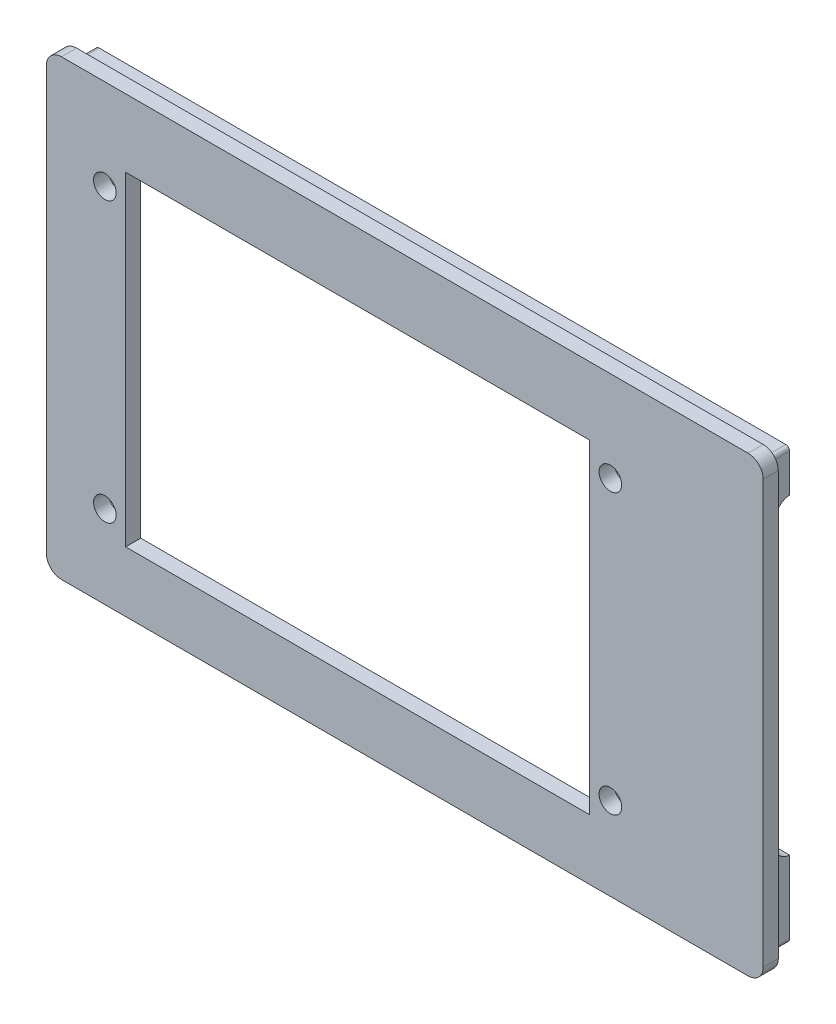
ISO-10303-21;
HEADER;
FILE_DESCRIPTION(('STEP AP214'),'2;1');
FILE_NAME('part.step','',(''),(''),'','','');
FILE_SCHEMA(('AUTOMOTIVE_DESIGN { 1 0 10303 214 1 1 1 1 }'));
ENDSEC;
DATA;
#1=APPLICATION_CONTEXT('core data for automotive mechanical design processes');
#2=APPLICATION_PROTOCOL_DEFINITION('international standard','automotive_design',2000,#1);
#3=PRODUCT_CONTEXT('',#1,'mechanical');
#4=PRODUCT('Part','Part','',(#3));
#5=PRODUCT_RELATED_PRODUCT_CATEGORY('part','',(#4));
#6=PRODUCT_DEFINITION_FORMATION('','',#4);
#7=PRODUCT_DEFINITION_CONTEXT('part definition',#1,'design');
#8=PRODUCT_DEFINITION('design','',#6,#7);
#9=PRODUCT_DEFINITION_SHAPE('','',#8);
#10=(LENGTH_UNIT() NAMED_UNIT(*) SI_UNIT(.MILLI.,.METRE.));
#11=(NAMED_UNIT(*) PLANE_ANGLE_UNIT() SI_UNIT($,.RADIAN.));
#12=(NAMED_UNIT(*) SI_UNIT($,.STERADIAN.) SOLID_ANGLE_UNIT());
#13=UNCERTAINTY_MEASURE_WITH_UNIT(LENGTH_MEASURE(1.E-05),#10,'distance_accuracy_value','');
#14=(GEOMETRIC_REPRESENTATION_CONTEXT(3) GLOBAL_UNCERTAINTY_ASSIGNED_CONTEXT((#13)) GLOBAL_UNIT_ASSIGNED_CONTEXT((#10,
#11,#12)) REPRESENTATION_CONTEXT('',''));
#15=CARTESIAN_POINT('',(0.,0.,0.));
#16=DIRECTION('',(0.,0.,1.));
#17=DIRECTION('',(1.,0.,0.));
#18=AXIS2_PLACEMENT_3D('',#15,#16,#17);
#19=CARTESIAN_POINT('',(93.,58.,0.));
#20=DIRECTION('',(0.,0.,-1.));
#21=DIRECTION('',(-1.,0.,0.));
#22=AXIS2_PLACEMENT_3D('',#19,#20,#21);
#23=PLANE('',#22);
#24=CARTESIAN_POINT('',(93.,58.,0.));
#25=DIRECTION('',(0.,0.,1.));
#26=DIRECTION('',(-1.,0.,0.));
#27=AXIS2_PLACEMENT_3D('',#24,#25,#26);
#28=CIRCLE('',#27,2.);
#29=CARTESIAN_POINT('',(95.,58.,0.));
#30=VERTEX_POINT('',#29);
#31=CARTESIAN_POINT('',(93.,60.,0.));
#32=VERTEX_POINT('',#31);
#33=EDGE_CURVE('E333',#30,#32,#28,.T.);
#34=ORIENTED_EDGE('',*,*,#33,.F.);
#35=DIRECTION('',(0.,1.,0.));
#36=VECTOR('',#35,1.);
#37=CARTESIAN_POINT('',(95.,2.00000000000001,0.));
#38=LINE('',#37,#36);
#39=CARTESIAN_POINT('',(95.,2.,0.));
#40=VERTEX_POINT('',#39);
#41=EDGE_CURVE('E338',#40,#30,#38,.T.);
#42=ORIENTED_EDGE('',*,*,#41,.F.);
#43=CARTESIAN_POINT('',(93.,2.,0.));
#44=DIRECTION('',(0.,0.,1.));
#45=DIRECTION('',(1.,0.,0.));
#46=AXIS2_PLACEMENT_3D('',#43,#44,#45);
#47=CIRCLE('',#46,2.);
#48=CARTESIAN_POINT('',(93.,0.,0.));
#49=VERTEX_POINT('',#48);
#50=EDGE_CURVE('E365',#49,#40,#47,.T.);
#51=ORIENTED_EDGE('',*,*,#50,.F.);
#52=DIRECTION('',(1.,0.,0.));
#53=VECTOR('',#52,1.);
#54=CARTESIAN_POINT('',(2.00000000000001,0.,0.));
#55=LINE('',#54,#53);
#56=CARTESIAN_POINT('',(2.00000000000001,0.,0.));
#57=VERTEX_POINT('',#56);
#58=EDGE_CURVE('E363',#57,#49,#55,.T.);
#59=ORIENTED_EDGE('',*,*,#58,.F.);
#60=CARTESIAN_POINT('',(2.,2.,0.));
#61=DIRECTION('',(0.,0.,1.));
#62=DIRECTION('',(-1.,0.,0.));
#63=AXIS2_PLACEMENT_3D('',#60,#61,#62);
#64=CIRCLE('',#63,2.);
#65=CARTESIAN_POINT('',(0.,2.00000000000001,0.));
#66=VERTEX_POINT('',#65);
#67=EDGE_CURVE('E361',#66,#57,#64,.T.);
#68=ORIENTED_EDGE('',*,*,#67,.F.);
#69=DIRECTION('',(0.,-1.,0.));
#70=VECTOR('',#69,1.);
#71=CARTESIAN_POINT('',(0.,2.00000000000001,0.));
#72=LINE('',#71,#70);
#73=CARTESIAN_POINT('',(0.,58.,0.));
#74=VERTEX_POINT('',#73);
#75=EDGE_CURVE('E359',#74,#66,#72,.T.);
#76=ORIENTED_EDGE('',*,*,#75,.F.);
#77=CARTESIAN_POINT('',(2.,58.,0.));
#78=DIRECTION('',(0.,0.,1.));
#79=DIRECTION('',(-1.,0.,0.));
#80=AXIS2_PLACEMENT_3D('',#77,#78,#79);
#81=CIRCLE('',#80,2.);
#82=CARTESIAN_POINT('',(2.00000000000001,60.,0.));
#83=VERTEX_POINT('',#82);
#84=EDGE_CURVE('E357',#83,#74,#81,.T.);
#85=ORIENTED_EDGE('',*,*,#84,.F.);
#86=DIRECTION('',(-1.,0.,0.));
#87=VECTOR('',#86,1.);
#88=CARTESIAN_POINT('',(2.00000000000001,60.,0.));
#89=LINE('',#88,#87);
#90=EDGE_CURVE('E355',#32,#83,#89,.T.);
#91=ORIENTED_EDGE('',*,*,#90,.F.);
#92=EDGE_LOOP('',(#34,#42,#51,#59,#68,#76,#85,#91));
#93=FACE_BOUND('',#92,.T.);
#94=DIRECTION('',(0.,-1.,0.));
#95=VECTOR('',#94,1.);
#96=CARTESIAN_POINT('',(93.5,58.,0.));
#97=LINE('',#96,#95);
#98=CARTESIAN_POINT('',(93.5,58.,0.));
#99=VERTEX_POINT('',#98);
#100=CARTESIAN_POINT('',(93.5,2.,0.));
#101=VERTEX_POINT('',#100);
#102=EDGE_CURVE('E270',#99,#101,#97,.T.);
#103=ORIENTED_EDGE('',*,*,#102,.F.);
#104=CARTESIAN_POINT('',(93.,58.,0.));
#105=DIRECTION('',(0.,0.,-1.));
#106=DIRECTION('',(-1.,0.,0.));
#107=AXIS2_PLACEMENT_3D('',#104,#105,#106);
#108=CIRCLE('',#107,0.5);
#109=CARTESIAN_POINT('',(93.,58.5,0.));
#110=VERTEX_POINT('',#109);
#111=EDGE_CURVE('E267',#110,#99,#108,.T.);
#112=ORIENTED_EDGE('',*,*,#111,.F.);
#113=DIRECTION('',(1.,0.,0.));
#114=VECTOR('',#113,1.);
#115=CARTESIAN_POINT('',(2.,58.5,0.));
#116=LINE('',#115,#114);
#117=CARTESIAN_POINT('',(2.,58.5,0.));
#118=VERTEX_POINT('',#117);
#119=EDGE_CURVE('E251',#118,#110,#116,.T.);
#120=ORIENTED_EDGE('',*,*,#119,.F.);
#121=CARTESIAN_POINT('',(2.,58.,0.));
#122=DIRECTION('',(0.,0.,-1.));
#123=DIRECTION('',(-1.,0.,0.));
#124=AXIS2_PLACEMENT_3D('',#121,#122,#123);
#125=CIRCLE('',#124,0.500000000000001);
#126=CARTESIAN_POINT('',(1.5,58.,0.));
#127=VERTEX_POINT('',#126);
#128=EDGE_CURVE('E281',#127,#118,#125,.T.);
#129=ORIENTED_EDGE('',*,*,#128,.F.);
#130=DIRECTION('',(0.,1.,0.));
#131=VECTOR('',#130,1.);
#132=CARTESIAN_POINT('',(1.5,2.,0.));
#133=LINE('',#132,#131);
#134=CARTESIAN_POINT('',(1.5,2.,0.));
#135=VERTEX_POINT('',#134);
#136=EDGE_CURVE('E279',#135,#127,#133,.T.);
#137=ORIENTED_EDGE('',*,*,#136,.F.);
#138=CARTESIAN_POINT('',(2.,2.,0.));
#139=DIRECTION('',(0.,0.,-1.));
#140=DIRECTION('',(-1.,0.,0.));
#141=AXIS2_PLACEMENT_3D('',#138,#139,#140);
#142=CIRCLE('',#141,0.5);
#143=CARTESIAN_POINT('',(2.00000000000002,1.5,0.));
#144=VERTEX_POINT('',#143);
#145=EDGE_CURVE('E277',#144,#135,#142,.T.);
#146=ORIENTED_EDGE('',*,*,#145,.F.);
#147=DIRECTION('',(-1.,0.,0.));
#148=VECTOR('',#147,1.);
#149=CARTESIAN_POINT('',(93.,1.5,0.));
#150=LINE('',#149,#148);
#151=CARTESIAN_POINT('',(93.,1.5,0.));
#152=VERTEX_POINT('',#151);
#153=EDGE_CURVE('E275',#152,#144,#150,.T.);
#154=ORIENTED_EDGE('',*,*,#153,.F.);
#155=CARTESIAN_POINT('',(93.,2.,0.));
#156=DIRECTION('',(0.,0.,-1.));
#157=DIRECTION('',(-1.,0.,0.));
#158=AXIS2_PLACEMENT_3D('',#155,#156,#157);
#159=CIRCLE('',#158,0.500000000000001);
#160=EDGE_CURVE('E273',#101,#152,#159,.T.);
#161=ORIENTED_EDGE('',*,*,#160,.F.);
#162=EDGE_LOOP('',(#103,#112,#120,#129,#137,#146,#154,#161));
#163=FACE_BOUND('',#162,.T.);
#164=ADVANCED_FACE('F34',(#93,#163),#23,.T.);
#165=CARTESIAN_POINT('',(93.,58.,2.));
#166=DIRECTION('',(0.,0.,-1.));
#167=DIRECTION('',(-1.,0.,0.));
#168=AXIS2_PLACEMENT_3D('',#165,#166,#167);
#169=PLANE('',#168);
#170=CARTESIAN_POINT('',(74.75,48.,2.));
#171=DIRECTION('',(0.,0.,1.));
#172=DIRECTION('',(1.,0.,0.));
#173=AXIS2_PLACEMENT_3D('',#170,#171,#172);
#174=CIRCLE('',#173,1.5);
#175=CARTESIAN_POINT('',(76.25,48.,2.));
#176=VERTEX_POINT('',#175);
#177=EDGE_CURVE('E763',#176,#176,#174,.T.);
#178=ORIENTED_EDGE('',*,*,#177,.F.);
#179=EDGE_LOOP('',(#178));
#180=FACE_BOUND('',#179,.T.);
#181=CARTESIAN_POINT('',(7.75000000000001,11.,2.));
#182=DIRECTION('',(0.,0.,1.));
#183=DIRECTION('',(1.,0.,0.));
#184=AXIS2_PLACEMENT_3D('',#181,#182,#183);
#185=CIRCLE('',#184,1.5);
#186=CARTESIAN_POINT('',(9.25000000000001,11.,2.));
#187=VERTEX_POINT('',#186);
#188=EDGE_CURVE('E820',#187,#187,#185,.T.);
#189=ORIENTED_EDGE('',*,*,#188,.F.);
#190=EDGE_LOOP('',(#189));
#191=FACE_BOUND('',#190,.T.);
#192=CARTESIAN_POINT('',(74.75,11.,2.));
#193=DIRECTION('',(0.,0.,1.));
#194=DIRECTION('',(1.,0.,0.));
#195=AXIS2_PLACEMENT_3D('',#192,#193,#194);
#196=CIRCLE('',#195,1.5);
#197=CARTESIAN_POINT('',(76.25,11.,2.));
#198=VERTEX_POINT('',#197);
#199=EDGE_CURVE('E814',#198,#198,#196,.T.);
#200=ORIENTED_EDGE('',*,*,#199,.F.);
#201=EDGE_LOOP('',(#200));
#202=FACE_BOUND('',#201,.T.);
#203=CARTESIAN_POINT('',(7.75000000000001,48.,2.));
#204=DIRECTION('',(0.,0.,1.));
#205=DIRECTION('',(1.,0.,0.));
#206=AXIS2_PLACEMENT_3D('',#203,#204,#205);
#207=CIRCLE('',#206,1.5);
#208=CARTESIAN_POINT('',(9.25000000000001,48.,2.));
#209=VERTEX_POINT('',#208);
#210=EDGE_CURVE('E758',#209,#209,#207,.T.);
#211=ORIENTED_EDGE('',*,*,#210,.F.);
#212=EDGE_LOOP('',(#211));
#213=FACE_BOUND('',#212,.T.);
#214=CARTESIAN_POINT('',(93.,58.,2.));
#215=DIRECTION('',(0.,0.,1.));
#216=DIRECTION('',(-1.,0.,0.));
#217=AXIS2_PLACEMENT_3D('',#214,#215,#216);
#218=CIRCLE('',#217,2.);
#219=CARTESIAN_POINT('',(95.,58.,2.));
#220=VERTEX_POINT('',#219);
#221=CARTESIAN_POINT('',(93.,60.,2.));
#222=VERTEX_POINT('',#221);
#223=EDGE_CURVE('E334',#220,#222,#218,.T.);
#224=ORIENTED_EDGE('',*,*,#223,.T.);
#225=DIRECTION('',(-1.,0.,0.));
#226=VECTOR('',#225,1.);
#227=CARTESIAN_POINT('',(2.00000000000001,60.,2.));
#228=LINE('',#227,#226);
#229=CARTESIAN_POINT('',(2.00000000000001,60.,2.));
#230=VERTEX_POINT('',#229);
#231=EDGE_CURVE('E337',#222,#230,#228,.T.);
#232=ORIENTED_EDGE('',*,*,#231,.T.);
#233=CARTESIAN_POINT('',(2.,58.,2.));
#234=DIRECTION('',(0.,0.,1.));
#235=DIRECTION('',(-1.,0.,0.));
#236=AXIS2_PLACEMENT_3D('',#233,#234,#235);
#237=CIRCLE('',#236,2.);
#238=CARTESIAN_POINT('',(0.,58.,2.));
#239=VERTEX_POINT('',#238);
#240=EDGE_CURVE('E340',#230,#239,#237,.T.);
#241=ORIENTED_EDGE('',*,*,#240,.T.);
#242=DIRECTION('',(0.,-1.,0.));
#243=VECTOR('',#242,1.);
#244=CARTESIAN_POINT('',(0.,2.00000000000001,2.));
#245=LINE('',#244,#243);
#246=CARTESIAN_POINT('',(0.,2.00000000000001,2.));
#247=VERTEX_POINT('',#246);
#248=EDGE_CURVE('E342',#239,#247,#245,.T.);
#249=ORIENTED_EDGE('',*,*,#248,.T.);
#250=CARTESIAN_POINT('',(2.,2.,2.));
#251=DIRECTION('',(0.,0.,1.));
#252=DIRECTION('',(-1.,0.,0.));
#253=AXIS2_PLACEMENT_3D('',#250,#251,#252);
#254=CIRCLE('',#253,2.);
#255=CARTESIAN_POINT('',(2.00000000000001,0.,2.));
#256=VERTEX_POINT('',#255);
#257=EDGE_CURVE('E344',#247,#256,#254,.T.);
#258=ORIENTED_EDGE('',*,*,#257,.T.);
#259=DIRECTION('',(1.,0.,0.));
#260=VECTOR('',#259,1.);
#261=CARTESIAN_POINT('',(2.00000000000001,0.,2.));
#262=LINE('',#261,#260);
#263=CARTESIAN_POINT('',(93.,0.,2.));
#264=VERTEX_POINT('',#263);
#265=EDGE_CURVE('E346',#256,#264,#262,.T.);
#266=ORIENTED_EDGE('',*,*,#265,.T.);
#267=CARTESIAN_POINT('',(93.,2.,2.));
#268=DIRECTION('',(0.,0.,1.));
#269=DIRECTION('',(1.,0.,0.));
#270=AXIS2_PLACEMENT_3D('',#267,#268,#269);
#271=CIRCLE('',#270,2.);
#272=CARTESIAN_POINT('',(95.,2.,2.));
#273=VERTEX_POINT('',#272);
#274=EDGE_CURVE('E348',#264,#273,#271,.T.);
#275=ORIENTED_EDGE('',*,*,#274,.T.);
#276=DIRECTION('',(0.,1.,0.));
#277=VECTOR('',#276,1.);
#278=CARTESIAN_POINT('',(95.,2.00000000000001,2.));
#279=LINE('',#278,#277);
#280=EDGE_CURVE('E350',#273,#220,#279,.T.);
#281=ORIENTED_EDGE('',*,*,#280,.T.);
#282=EDGE_LOOP('',(#224,#232,#241,#249,#258,#266,#275,#281));
#283=FACE_BOUND('',#282,.T.);
#284=DIRECTION('',(0.,-1.,0.));
#285=VECTOR('',#284,1.);
#286=CARTESIAN_POINT('',(10.5,51.,2.));
#287=LINE('',#286,#285);
#288=CARTESIAN_POINT('',(10.5,51.,2.));
#289=VERTEX_POINT('',#288);
#290=CARTESIAN_POINT('',(10.5,8.,2.));
#291=VERTEX_POINT('',#290);
#292=EDGE_CURVE('E303',#289,#291,#287,.T.);
#293=ORIENTED_EDGE('',*,*,#292,.F.);
#294=DIRECTION('',(-1.,0.,0.));
#295=VECTOR('',#294,1.);
#296=CARTESIAN_POINT('',(10.5,51.,2.));
#297=LINE('',#296,#295);
#298=CARTESIAN_POINT('',(72.,51.,2.));
#299=VERTEX_POINT('',#298);
#300=EDGE_CURVE('E311',#299,#289,#297,.T.);
#301=ORIENTED_EDGE('',*,*,#300,.F.);
#302=DIRECTION('',(0.,1.,0.));
#303=VECTOR('',#302,1.);
#304=CARTESIAN_POINT('',(72.,51.,2.));
#305=LINE('',#304,#303);
#306=CARTESIAN_POINT('',(72.,8.,2.));
#307=VERTEX_POINT('',#306);
#308=EDGE_CURVE('E308',#307,#299,#305,.T.);
#309=ORIENTED_EDGE('',*,*,#308,.F.);
#310=DIRECTION('',(1.,0.,0.));
#311=VECTOR('',#310,1.);
#312=CARTESIAN_POINT('',(10.5,8.,2.));
#313=LINE('',#312,#311);
#314=EDGE_CURVE('E305',#291,#307,#313,.T.);
#315=ORIENTED_EDGE('',*,*,#314,.F.);
#316=EDGE_LOOP('',(#293,#301,#309,#315));
#317=FACE_BOUND('',#316,.T.);
#318=ADVANCED_FACE('F408',(#180,#191,#202,#213,#283,#317),#169,.F.);
#319=CARTESIAN_POINT('',(74.75,48.,0.));
#320=DIRECTION('',(0.,0.,-1.));
#321=DIRECTION('',(-1.,0.,0.));
#322=AXIS2_PLACEMENT_3D('',#319,#320,#321);
#323=CIRCLE('',#322,1.5);
#324=CARTESIAN_POINT('',(73.25,48.,0.));
#325=VERTEX_POINT('',#324);
#326=EDGE_CURVE('E452',#325,#325,#323,.F.);
#327=ORIENTED_EDGE('',*,*,#326,.T.);
#328=EDGE_LOOP('',(#327));
#329=FACE_BOUND('',#328,.T.);
#330=CARTESIAN_POINT('',(7.75000000000001,11.,0.));
#331=DIRECTION('',(0.,0.,-1.));
#332=DIRECTION('',(-1.,0.,0.));
#333=AXIS2_PLACEMENT_3D('',#330,#331,#332);
#334=CIRCLE('',#333,1.5);
#335=CARTESIAN_POINT('',(6.25000000000001,11.,0.));
#336=VERTEX_POINT('',#335);
#337=EDGE_CURVE('E456',#336,#336,#334,.F.);
#338=ORIENTED_EDGE('',*,*,#337,.T.);
#339=EDGE_LOOP('',(#338));
#340=FACE_BOUND('',#339,.T.);
#341=CARTESIAN_POINT('',(74.75,11.,0.));
#342=DIRECTION('',(0.,0.,-1.));
#343=DIRECTION('',(-1.,0.,0.));
#344=AXIS2_PLACEMENT_3D('',#341,#342,#343);
#345=CIRCLE('',#344,1.5);
#346=CARTESIAN_POINT('',(73.25,11.,0.));
#347=VERTEX_POINT('',#346);
#348=EDGE_CURVE('E460',#347,#347,#345,.F.);
#349=ORIENTED_EDGE('',*,*,#348,.T.);
#350=EDGE_LOOP('',(#349));
#351=FACE_BOUND('',#350,.T.);
#352=CARTESIAN_POINT('',(7.75000000000001,48.,0.));
#353=DIRECTION('',(0.,0.,-1.));
#354=DIRECTION('',(-1.,0.,0.));
#355=AXIS2_PLACEMENT_3D('',#352,#353,#354);
#356=CIRCLE('',#355,1.5);
#357=CARTESIAN_POINT('',(6.25000000000001,48.,0.));
#358=VERTEX_POINT('',#357);
#359=EDGE_CURVE('E464',#358,#358,#356,.F.);
#360=ORIENTED_EDGE('',*,*,#359,.T.);
#361=EDGE_LOOP('',(#360));
#362=FACE_BOUND('',#361,.T.);
#363=DIRECTION('',(1.,0.,0.));
#364=VECTOR('',#363,1.);
#365=CARTESIAN_POINT('',(3.,57.,0.));
#366=LINE('',#365,#364);
#367=CARTESIAN_POINT('',(3.,57.,0.));
#368=VERTEX_POINT('',#367);
#369=CARTESIAN_POINT('',(92.,57.,0.));
#370=VERTEX_POINT('',#369);
#371=EDGE_CURVE('E467',#368,#370,#366,.T.);
#372=ORIENTED_EDGE('',*,*,#371,.T.);
#373=DIRECTION('',(0.,-1.,0.));
#374=VECTOR('',#373,1.);
#375=CARTESIAN_POINT('',(92.,57.,0.));
#376=LINE('',#375,#374);
#377=CARTESIAN_POINT('',(92.,3.,0.));
#378=VERTEX_POINT('',#377);
#379=EDGE_CURVE('E761',#370,#378,#376,.T.);
#380=ORIENTED_EDGE('',*,*,#379,.T.);
#381=DIRECTION('',(-1.,0.,0.));
#382=VECTOR('',#381,1.);
#383=CARTESIAN_POINT('',(92.,3.,0.));
#384=LINE('',#383,#382);
#385=CARTESIAN_POINT('',(3.,3.,0.));
#386=VERTEX_POINT('',#385);
#387=EDGE_CURVE('E781',#378,#386,#384,.T.);
#388=ORIENTED_EDGE('',*,*,#387,.T.);
#389=DIRECTION('',(0.,1.,0.));
#390=VECTOR('',#389,1.);
#391=CARTESIAN_POINT('',(3.,3.,0.));
#392=LINE('',#391,#390);
#393=EDGE_CURVE('E770',#386,#368,#392,.T.);
#394=ORIENTED_EDGE('',*,*,#393,.T.);
#395=EDGE_LOOP('',(#372,#380,#388,#394));
#396=FACE_BOUND('',#395,.T.);
#397=DIRECTION('',(-1.,0.,0.));
#398=VECTOR('',#397,1.);
#399=CARTESIAN_POINT('',(10.5,51.,0.));
#400=LINE('',#399,#398);
#401=CARTESIAN_POINT('',(72.,51.,0.));
#402=VERTEX_POINT('',#401);
#403=CARTESIAN_POINT('',(10.5,51.,0.));
#404=VERTEX_POINT('',#403);
#405=EDGE_CURVE('E306',#402,#404,#400,.T.);
#406=ORIENTED_EDGE('',*,*,#405,.T.);
#407=DIRECTION('',(0.,-1.,0.));
#408=VECTOR('',#407,1.);
#409=CARTESIAN_POINT('',(10.5,51.,0.));
#410=LINE('',#409,#408);
#411=CARTESIAN_POINT('',(10.5,8.,0.));
#412=VERTEX_POINT('',#411);
#413=EDGE_CURVE('E302',#404,#412,#410,.T.);
#414=ORIENTED_EDGE('',*,*,#413,.T.);
#415=DIRECTION('',(1.,0.,0.));
#416=VECTOR('',#415,1.);
#417=CARTESIAN_POINT('',(10.5,8.,0.));
#418=LINE('',#417,#416);
#419=CARTESIAN_POINT('',(72.,8.,0.));
#420=VERTEX_POINT('',#419);
#421=EDGE_CURVE('E316',#412,#420,#418,.T.);
#422=ORIENTED_EDGE('',*,*,#421,.T.);
#423=DIRECTION('',(0.,1.,0.));
#424=VECTOR('',#423,1.);
#425=CARTESIAN_POINT('',(72.,51.,0.));
#426=LINE('',#425,#424);
#427=EDGE_CURVE('E319',#420,#402,#426,.T.);
#428=ORIENTED_EDGE('',*,*,#427,.T.);
#429=EDGE_LOOP('',(#406,#414,#422,#428));
#430=FACE_BOUND('',#429,.T.);
#431=ADVANCED_FACE('F437',(#329,#340,#351,#362,#396,#430),#23,.T.);
#432=CARTESIAN_POINT('',(93.,58.,2.));
#433=DIRECTION('',(0.,0.,-1.));
#434=DIRECTION('',(-1.,0.,0.));
#435=AXIS2_PLACEMENT_3D('',#432,#433,#434);
#436=CYLINDRICAL_SURFACE('',#435,2.);
#437=ORIENTED_EDGE('',*,*,#33,.T.);
#438=DIRECTION('',(0.,0.,-1.));
#439=VECTOR('',#438,1.);
#440=CARTESIAN_POINT('',(93.,60.,2.));
#441=LINE('',#440,#439);
#442=EDGE_CURVE('E11',#222,#32,#441,.T.);
#443=ORIENTED_EDGE('',*,*,#442,.F.);
#444=ORIENTED_EDGE('',*,*,#223,.F.);
#445=DIRECTION('',(0.,0.,-1.));
#446=VECTOR('',#445,1.);
#447=CARTESIAN_POINT('',(95.,58.,2.));
#448=LINE('',#447,#446);
#449=EDGE_CURVE('E352',#220,#30,#448,.T.);
#450=ORIENTED_EDGE('',*,*,#449,.T.);
#451=EDGE_LOOP('',(#437,#443,#444,#450));
#452=FACE_BOUND('',#451,.T.);
#453=ADVANCED_FACE('F36',(#452),#436,.T.);
#454=CARTESIAN_POINT('',(2.00000000000001,60.,2.));
#455=DIRECTION('',(0.,-1.,0.));
#456=DIRECTION('',(0.,0.,-1.));
#457=AXIS2_PLACEMENT_3D('',#454,#455,#456);
#458=PLANE('',#457);
#459=ORIENTED_EDGE('',*,*,#90,.T.);
#460=DIRECTION('',(0.,0.,-1.));
#461=VECTOR('',#460,1.);
#462=CARTESIAN_POINT('',(2.00000000000001,60.,2.));
#463=LINE('',#462,#461);
#464=EDGE_CURVE('E42',#230,#83,#463,.T.);
#465=ORIENTED_EDGE('',*,*,#464,.F.);
#466=ORIENTED_EDGE('',*,*,#231,.F.);
#467=ORIENTED_EDGE('',*,*,#442,.T.);
#468=EDGE_LOOP('',(#459,#465,#466,#467));
#469=FACE_BOUND('',#468,.T.);
#470=ADVANCED_FACE('F413',(#469),#458,.F.);
#471=CARTESIAN_POINT('',(2.,58.,2.));
#472=DIRECTION('',(0.,0.,-1.));
#473=DIRECTION('',(-1.,0.,0.));
#474=AXIS2_PLACEMENT_3D('',#471,#472,#473);
#475=CYLINDRICAL_SURFACE('',#474,2.);
#476=ORIENTED_EDGE('',*,*,#84,.T.);
#477=DIRECTION('',(0.,0.,-1.));
#478=VECTOR('',#477,1.);
#479=CARTESIAN_POINT('',(0.,58.,2.));
#480=LINE('',#479,#478);
#481=EDGE_CURVE('E382',#239,#74,#480,.T.);
#482=ORIENTED_EDGE('',*,*,#481,.F.);
#483=ORIENTED_EDGE('',*,*,#240,.F.);
#484=ORIENTED_EDGE('',*,*,#464,.T.);
#485=EDGE_LOOP('',(#476,#482,#483,#484));
#486=FACE_BOUND('',#485,.T.);
#487=ADVANCED_FACE('F389',(#486),#475,.T.);
#488=CARTESIAN_POINT('',(0.,2.00000000000001,2.));
#489=DIRECTION('',(1.,0.,0.));
#490=DIRECTION('',(0.,0.,-1.));
#491=AXIS2_PLACEMENT_3D('',#488,#489,#490);
#492=PLANE('',#491);
#493=ORIENTED_EDGE('',*,*,#75,.T.);
#494=DIRECTION('',(0.,0.,-1.));
#495=VECTOR('',#494,1.);
#496=CARTESIAN_POINT('',(0.,2.00000000000001,2.));
#497=LINE('',#496,#495);
#498=EDGE_CURVE('E379',#247,#66,#497,.T.);
#499=ORIENTED_EDGE('',*,*,#498,.F.);
#500=ORIENTED_EDGE('',*,*,#248,.F.);
#501=ORIENTED_EDGE('',*,*,#481,.T.);
#502=EDGE_LOOP('',(#493,#499,#500,#501));
#503=FACE_BOUND('',#502,.T.);
#504=ADVANCED_FACE('F400',(#503),#492,.F.);
#505=CARTESIAN_POINT('',(2.,2.,2.));
#506=DIRECTION('',(0.,0.,-1.));
#507=DIRECTION('',(-1.,0.,0.));
#508=AXIS2_PLACEMENT_3D('',#505,#506,#507);
#509=CYLINDRICAL_SURFACE('',#508,2.);
#510=ORIENTED_EDGE('',*,*,#67,.T.);
#511=DIRECTION('',(0.,0.,-1.));
#512=VECTOR('',#511,1.);
#513=CARTESIAN_POINT('',(2.00000000000001,0.,2.));
#514=LINE('',#513,#512);
#515=EDGE_CURVE('E376',#256,#57,#514,.T.);
#516=ORIENTED_EDGE('',*,*,#515,.F.);
#517=ORIENTED_EDGE('',*,*,#257,.F.);
#518=ORIENTED_EDGE('',*,*,#498,.T.);
#519=EDGE_LOOP('',(#510,#516,#517,#518));
#520=FACE_BOUND('',#519,.T.);
#521=ADVANCED_FACE('F404',(#520),#509,.T.);
#522=CARTESIAN_POINT('',(2.00000000000001,0.,2.));
#523=DIRECTION('',(0.,1.,0.));
#524=DIRECTION('',(0.,0.,1.));
#525=AXIS2_PLACEMENT_3D('',#522,#523,#524);
#526=PLANE('',#525);
#527=ORIENTED_EDGE('',*,*,#58,.T.);
#528=DIRECTION('',(0.,0.,-1.));
#529=VECTOR('',#528,1.);
#530=CARTESIAN_POINT('',(93.,0.,2.));
#531=LINE('',#530,#529);
#532=EDGE_CURVE('E373',#264,#49,#531,.T.);
#533=ORIENTED_EDGE('',*,*,#532,.F.);
#534=ORIENTED_EDGE('',*,*,#265,.F.);
#535=ORIENTED_EDGE('',*,*,#515,.T.);
#536=EDGE_LOOP('',(#527,#533,#534,#535));
#537=FACE_BOUND('',#536,.T.);
#538=ADVANCED_FACE('F426',(#537),#526,.F.);
#539=CARTESIAN_POINT('',(93.,2.,2.));
#540=DIRECTION('',(0.,0.,-1.));
#541=DIRECTION('',(-1.,0.,0.));
#542=AXIS2_PLACEMENT_3D('',#539,#540,#541);
#543=CYLINDRICAL_SURFACE('',#542,2.);
#544=ORIENTED_EDGE('',*,*,#50,.T.);
#545=DIRECTION('',(0.,0.,-1.));
#546=VECTOR('',#545,1.);
#547=CARTESIAN_POINT('',(95.,2.,2.));
#548=LINE('',#547,#546);
#549=EDGE_CURVE('E370',#273,#40,#548,.T.);
#550=ORIENTED_EDGE('',*,*,#549,.F.);
#551=ORIENTED_EDGE('',*,*,#274,.F.);
#552=ORIENTED_EDGE('',*,*,#532,.T.);
#553=EDGE_LOOP('',(#544,#550,#551,#552));
#554=FACE_BOUND('',#553,.T.);
#555=ADVANCED_FACE('F424',(#554),#543,.T.);
#556=CARTESIAN_POINT('',(95.,2.00000000000001,2.));
#557=DIRECTION('',(-1.,0.,0.));
#558=DIRECTION('',(0.,0.,1.));
#559=AXIS2_PLACEMENT_3D('',#556,#557,#558);
#560=PLANE('',#559);
#561=ORIENTED_EDGE('',*,*,#41,.T.);
#562=ORIENTED_EDGE('',*,*,#449,.F.);
#563=ORIENTED_EDGE('',*,*,#280,.F.);
#564=ORIENTED_EDGE('',*,*,#549,.T.);
#565=EDGE_LOOP('',(#561,#562,#563,#564));
#566=FACE_BOUND('',#565,.T.);
#567=ADVANCED_FACE('F419',(#566),#560,.F.);
#568=CARTESIAN_POINT('',(10.5,51.,2.));
#569=DIRECTION('',(1.,0.,0.));
#570=DIRECTION('',(0.,1.,0.));
#571=AXIS2_PLACEMENT_3D('',#568,#569,#570);
#572=PLANE('',#571);
#573=ORIENTED_EDGE('',*,*,#413,.F.);
#574=DIRECTION('',(0.,0.,-1.));
#575=VECTOR('',#574,1.);
#576=CARTESIAN_POINT('',(10.5,51.,2.));
#577=LINE('',#576,#575);
#578=EDGE_CURVE('E313',#289,#404,#577,.T.);
#579=ORIENTED_EDGE('',*,*,#578,.F.);
#580=ORIENTED_EDGE('',*,*,#292,.T.);
#581=DIRECTION('',(0.,0.,-1.));
#582=VECTOR('',#581,1.);
#583=CARTESIAN_POINT('',(10.5,8.,2.));
#584=LINE('',#583,#582);
#585=EDGE_CURVE('E330',#291,#412,#584,.T.);
#586=ORIENTED_EDGE('',*,*,#585,.T.);
#587=EDGE_LOOP('',(#573,#579,#580,#586));
#588=FACE_BOUND('',#587,.T.);
#589=ADVANCED_FACE('F477',(#588),#572,.T.);
#590=CARTESIAN_POINT('',(10.5,8.,2.));
#591=DIRECTION('',(0.,1.,0.));
#592=DIRECTION('',(0.,0.,1.));
#593=AXIS2_PLACEMENT_3D('',#590,#591,#592);
#594=PLANE('',#593);
#595=ORIENTED_EDGE('',*,*,#421,.F.);
#596=ORIENTED_EDGE('',*,*,#585,.F.);
#597=ORIENTED_EDGE('',*,*,#314,.T.);
#598=DIRECTION('',(0.,0.,-1.));
#599=VECTOR('',#598,1.);
#600=CARTESIAN_POINT('',(72.,8.,2.));
#601=LINE('',#600,#599);
#602=EDGE_CURVE('E328',#307,#420,#601,.T.);
#603=ORIENTED_EDGE('',*,*,#602,.T.);
#604=EDGE_LOOP('',(#595,#596,#597,#603));
#605=FACE_BOUND('',#604,.T.);
#606=ADVANCED_FACE('F483',(#605),#594,.T.);
#607=CARTESIAN_POINT('',(72.,51.,2.));
#608=DIRECTION('',(-1.,0.,0.));
#609=DIRECTION('',(0.,-1.,0.));
#610=AXIS2_PLACEMENT_3D('',#607,#608,#609);
#611=PLANE('',#610);
#612=ORIENTED_EDGE('',*,*,#427,.F.);
#613=ORIENTED_EDGE('',*,*,#602,.F.);
#614=ORIENTED_EDGE('',*,*,#308,.T.);
#615=DIRECTION('',(0.,0.,-1.));
#616=VECTOR('',#615,1.);
#617=CARTESIAN_POINT('',(72.,51.,2.));
#618=LINE('',#617,#616);
#619=EDGE_CURVE('E326',#299,#402,#618,.T.);
#620=ORIENTED_EDGE('',*,*,#619,.T.);
#621=EDGE_LOOP('',(#612,#613,#614,#620));
#622=FACE_BOUND('',#621,.T.);
#623=ADVANCED_FACE('F485',(#622),#611,.T.);
#624=CARTESIAN_POINT('',(10.5,51.,2.));
#625=DIRECTION('',(0.,-1.,0.));
#626=DIRECTION('',(0.,0.,-1.));
#627=AXIS2_PLACEMENT_3D('',#624,#625,#626);
#628=PLANE('',#627);
#629=ORIENTED_EDGE('',*,*,#405,.F.);
#630=ORIENTED_EDGE('',*,*,#619,.F.);
#631=ORIENTED_EDGE('',*,*,#300,.T.);
#632=ORIENTED_EDGE('',*,*,#578,.T.);
#633=EDGE_LOOP('',(#629,#630,#631,#632));
#634=FACE_BOUND('',#633,.T.);
#635=ADVANCED_FACE('F472',(#634),#628,.T.);
#636=CARTESIAN_POINT('',(93.,58.,-3.));
#637=DIRECTION('',(0.,0.,-1.));
#638=DIRECTION('',(-1.,0.,0.));
#639=AXIS2_PLACEMENT_3D('',#636,#637,#638);
#640=PLANE('',#639);
#641=DIRECTION('',(1.,0.,0.));
#642=VECTOR('',#641,1.);
#643=CARTESIAN_POINT('',(-0.001000000000001,11.623250188063,-3.));
#644=LINE('',#643,#642);
#645=CARTESIAN_POINT('',(92.,11.623250188063,-3.));
#646=VERTEX_POINT('',#645);
#647=CARTESIAN_POINT('',(93.5,11.623250188063,-3.));
#648=VERTEX_POINT('',#647);
#649=EDGE_CURVE('E222',#646,#648,#644,.T.);
#650=ORIENTED_EDGE('',*,*,#649,.T.);
#651=DIRECTION('',(0.,-1.,0.));
#652=VECTOR('',#651,1.);
#653=CARTESIAN_POINT('',(93.5,58.,-3.));
#654=LINE('',#653,#652);
#655=CARTESIAN_POINT('',(93.5,2.,-3.));
#656=VERTEX_POINT('',#655);
#657=EDGE_CURVE('E235',#648,#656,#654,.T.);
#658=ORIENTED_EDGE('',*,*,#657,.T.);
#659=CARTESIAN_POINT('',(93.,2.,-3.));
#660=DIRECTION('',(0.,0.,-1.));
#661=DIRECTION('',(-1.,0.,0.));
#662=AXIS2_PLACEMENT_3D('',#659,#660,#661);
#663=CIRCLE('',#662,0.500000000000001);
#664=CARTESIAN_POINT('',(93.,1.5,-3.));
#665=VERTEX_POINT('',#664);
#666=EDGE_CURVE('E249',#656,#665,#663,.T.);
#667=ORIENTED_EDGE('',*,*,#666,.T.);
#668=DIRECTION('',(-1.,0.,0.));
#669=VECTOR('',#668,1.);
#670=CARTESIAN_POINT('',(93.,1.5,-3.));
#671=LINE('',#670,#669);
#672=CARTESIAN_POINT('',(2.00000000000002,1.5,-3.));
#673=VERTEX_POINT('',#672);
#674=EDGE_CURVE('E256',#665,#673,#671,.T.);
#675=ORIENTED_EDGE('',*,*,#674,.T.);
#676=CARTESIAN_POINT('',(2.,2.,-3.));
#677=DIRECTION('',(0.,0.,-1.));
#678=DIRECTION('',(-1.,0.,0.));
#679=AXIS2_PLACEMENT_3D('',#676,#677,#678);
#680=CIRCLE('',#679,0.5);
#681=CARTESIAN_POINT('',(1.5,2.,-3.));
#682=VERTEX_POINT('',#681);
#683=EDGE_CURVE('E258',#673,#682,#680,.T.);
#684=ORIENTED_EDGE('',*,*,#683,.T.);
#685=DIRECTION('',(0.,1.,0.));
#686=VECTOR('',#685,1.);
#687=CARTESIAN_POINT('',(1.5,2.,-3.));
#688=LINE('',#687,#686);
#689=CARTESIAN_POINT('',(1.5,58.,-3.));
#690=VERTEX_POINT('',#689);
#691=EDGE_CURVE('E260',#682,#690,#688,.T.);
#692=ORIENTED_EDGE('',*,*,#691,.T.);
#693=CARTESIAN_POINT('',(2.,58.,-3.));
#694=DIRECTION('',(0.,0.,-1.));
#695=DIRECTION('',(-1.,0.,0.));
#696=AXIS2_PLACEMENT_3D('',#693,#694,#695);
#697=CIRCLE('',#696,0.500000000000001);
#698=CARTESIAN_POINT('',(2.,58.5,-3.));
#699=VERTEX_POINT('',#698);
#700=EDGE_CURVE('E262',#690,#699,#697,.T.);
#701=ORIENTED_EDGE('',*,*,#700,.T.);
#702=DIRECTION('',(1.,0.,0.));
#703=VECTOR('',#702,1.);
#704=CARTESIAN_POINT('',(2.,58.5,-3.));
#705=LINE('',#704,#703);
#706=CARTESIAN_POINT('',(93.,58.5,-3.));
#707=VERTEX_POINT('',#706);
#708=EDGE_CURVE('E264',#699,#707,#705,.T.);
#709=ORIENTED_EDGE('',*,*,#708,.T.);
#710=CARTESIAN_POINT('',(93.,58.,-3.));
#711=DIRECTION('',(0.,0.,-1.));
#712=DIRECTION('',(-1.,0.,0.));
#713=AXIS2_PLACEMENT_3D('',#710,#711,#712);
#714=CIRCLE('',#713,0.5);
#715=CARTESIAN_POINT('',(93.5,58.,-3.));
#716=VERTEX_POINT('',#715);
#717=EDGE_CURVE('E246',#707,#716,#714,.T.);
#718=ORIENTED_EDGE('',*,*,#717,.T.);
#719=CARTESIAN_POINT('',(93.5,52.9397731770604,-3.));
#720=VERTEX_POINT('',#719);
#721=EDGE_CURVE('E245',#716,#720,#654,.T.);
#722=ORIENTED_EDGE('',*,*,#721,.T.);
#723=DIRECTION('',(1.,0.,0.));
#724=VECTOR('',#723,1.);
#725=CARTESIAN_POINT('',(-0.001000000000001,52.9397731770604,-3.));
#726=LINE('',#725,#724);
#727=CARTESIAN_POINT('',(92.,52.9397731770604,-3.));
#728=VERTEX_POINT('',#727);
#729=EDGE_CURVE('E239',#720,#728,#726,.F.);
#730=ORIENTED_EDGE('',*,*,#729,.T.);
#731=DIRECTION('',(0.,-1.,0.));
#732=VECTOR('',#731,1.);
#733=CARTESIAN_POINT('',(92.,57.,-3.));
#734=LINE('',#733,#732);
#735=CARTESIAN_POINT('',(92.,57.,-3.));
#736=VERTEX_POINT('',#735);
#737=EDGE_CURVE('E771',#736,#728,#734,.T.);
#738=ORIENTED_EDGE('',*,*,#737,.F.);
#739=DIRECTION('',(1.,0.,0.));
#740=VECTOR('',#739,1.);
#741=CARTESIAN_POINT('',(3.,57.,-3.));
#742=LINE('',#741,#740);
#743=CARTESIAN_POINT('',(3.,57.,-3.));
#744=VERTEX_POINT('',#743);
#745=EDGE_CURVE('E768',#744,#736,#742,.T.);
#746=ORIENTED_EDGE('',*,*,#745,.F.);
#747=DIRECTION('',(0.,1.,0.));
#748=VECTOR('',#747,1.);
#749=CARTESIAN_POINT('',(3.,3.,-3.));
#750=LINE('',#749,#748);
#751=CARTESIAN_POINT('',(3.,3.,-3.));
#752=VERTEX_POINT('',#751);
#753=EDGE_CURVE('E777',#752,#744,#750,.T.);
#754=ORIENTED_EDGE('',*,*,#753,.F.);
#755=DIRECTION('',(-1.,0.,0.));
#756=VECTOR('',#755,1.);
#757=CARTESIAN_POINT('',(92.,3.,-3.));
#758=LINE('',#757,#756);
#759=CARTESIAN_POINT('',(92.,3.,-3.));
#760=VERTEX_POINT('',#759);
#761=EDGE_CURVE('E774',#760,#752,#758,.T.);
#762=ORIENTED_EDGE('',*,*,#761,.F.);
#763=EDGE_CURVE('E238',#646,#760,#734,.T.);
#764=ORIENTED_EDGE('',*,*,#763,.F.);
#765=EDGE_LOOP('',(#650,#658,#667,#675,#684,#692,#701,#709,#718,#722,#730,#738,#746,#754,#762,#764));
#766=FACE_BOUND('',#765,.T.);
#767=ADVANCED_FACE('F234',(#766),#640,.T.);
#768=CARTESIAN_POINT('',(93.,58.,-3.));
#769=DIRECTION('',(0.,0.,1.));
#770=DIRECTION('',(1.,0.,0.));
#771=AXIS2_PLACEMENT_3D('',#768,#769,#770);
#772=CYLINDRICAL_SURFACE('',#771,0.5);
#773=ORIENTED_EDGE('',*,*,#111,.T.);
#774=DIRECTION('',(0.,0.,1.));
#775=VECTOR('',#774,1.);
#776=CARTESIAN_POINT('',(93.5,58.,-3.));
#777=LINE('',#776,#775);
#778=EDGE_CURVE('E300',#716,#99,#777,.T.);
#779=ORIENTED_EDGE('',*,*,#778,.F.);
#780=ORIENTED_EDGE('',*,*,#717,.F.);
#781=DIRECTION('',(0.,0.,1.));
#782=VECTOR('',#781,1.);
#783=CARTESIAN_POINT('',(93.,58.5,-3.));
#784=LINE('',#783,#782);
#785=EDGE_CURVE('E266',#707,#110,#784,.T.);
#786=ORIENTED_EDGE('',*,*,#785,.T.);
#787=EDGE_LOOP('',(#773,#779,#780,#786));
#788=FACE_BOUND('',#787,.T.);
#789=ADVANCED_FACE('F658',(#788),#772,.T.);
#790=CARTESIAN_POINT('',(93.5,58.,-3.));
#791=DIRECTION('',(-1.,0.,0.));
#792=DIRECTION('',(0.,0.,1.));
#793=AXIS2_PLACEMENT_3D('',#790,#791,#792);
#794=PLANE('',#793);
#795=ORIENTED_EDGE('',*,*,#657,.F.);
#796=CARTESIAN_POINT('',(93.5,13.621155890472,-3.09150302881255));
#797=DIRECTION('',(1.,0.,0.));
#798=DIRECTION('',(0.,0.,1.));
#799=AXIS2_PLACEMENT_3D('',#796,#797,#798);
#800=CIRCLE('',#799,2.);
#801=CARTESIAN_POINT('',(93.5,13.621155890472,-1.09150302881255));
#802=VERTEX_POINT('',#801);
#803=EDGE_CURVE('E219',#802,#648,#800,.T.);
#804=ORIENTED_EDGE('',*,*,#803,.F.);
#805=DIRECTION('',(0.,-1.,0.));
#806=VECTOR('',#805,1.);
#807=CARTESIAN_POINT('',(93.5,13.621155890472,-1.09150302881255));
#808=LINE('',#807,#806);
#809=CARTESIAN_POINT('',(93.5,50.9418674746514,-1.09150302881255));
#810=VERTEX_POINT('',#809);
#811=EDGE_CURVE('E230',#810,#802,#808,.T.);
#812=ORIENTED_EDGE('',*,*,#811,.F.);
#813=CARTESIAN_POINT('',(93.5,50.9418674746514,-3.09150302881255));
#814=DIRECTION('',(1.,0.,0.));
#815=DIRECTION('',(0.,0.,-1.));
#816=AXIS2_PLACEMENT_3D('',#813,#814,#815);
#817=CIRCLE('',#816,2.);
#818=EDGE_CURVE('E806',#720,#810,#817,.T.);
#819=ORIENTED_EDGE('',*,*,#818,.F.);
#820=ORIENTED_EDGE('',*,*,#721,.F.);
#821=ORIENTED_EDGE('',*,*,#778,.T.);
#822=ORIENTED_EDGE('',*,*,#102,.T.);
#823=DIRECTION('',(0.,0.,1.));
#824=VECTOR('',#823,1.);
#825=CARTESIAN_POINT('',(93.5,2.,-3.));
#826=LINE('',#825,#824);
#827=EDGE_CURVE('E243',#656,#101,#826,.T.);
#828=ORIENTED_EDGE('',*,*,#827,.F.);
#829=EDGE_LOOP('',(#795,#804,#812,#819,#820,#821,#822,#828));
#830=FACE_BOUND('',#829,.T.);
#831=ADVANCED_FACE('F241',(#830),#794,.F.);
#832=CARTESIAN_POINT('',(93.,2.,-3.));
#833=DIRECTION('',(0.,0.,1.));
#834=DIRECTION('',(1.,0.,0.));
#835=AXIS2_PLACEMENT_3D('',#832,#833,#834);
#836=CYLINDRICAL_SURFACE('',#835,0.500000000000001);
#837=ORIENTED_EDGE('',*,*,#160,.T.);
#838=DIRECTION('',(0.,0.,1.));
#839=VECTOR('',#838,1.);
#840=CARTESIAN_POINT('',(93.,1.5,-3.));
#841=LINE('',#840,#839);
#842=EDGE_CURVE('E296',#665,#152,#841,.T.);
#843=ORIENTED_EDGE('',*,*,#842,.F.);
#844=ORIENTED_EDGE('',*,*,#666,.F.);
#845=ORIENTED_EDGE('',*,*,#827,.T.);
#846=EDGE_LOOP('',(#837,#843,#844,#845));
#847=FACE_BOUND('',#846,.T.);
#848=ADVANCED_FACE('F641',(#847),#836,.T.);
#849=CARTESIAN_POINT('',(93.,1.5,-3.));
#850=DIRECTION('',(0.,1.,0.));
#851=DIRECTION('',(-1.,0.,0.));
#852=AXIS2_PLACEMENT_3D('',#849,#850,#851);
#853=PLANE('',#852);
#854=ORIENTED_EDGE('',*,*,#153,.T.);
#855=DIRECTION('',(0.,0.,1.));
#856=VECTOR('',#855,1.);
#857=CARTESIAN_POINT('',(2.00000000000002,1.5,-3.));
#858=LINE('',#857,#856);
#859=EDGE_CURVE('E293',#673,#144,#858,.T.);
#860=ORIENTED_EDGE('',*,*,#859,.F.);
#861=ORIENTED_EDGE('',*,*,#674,.F.);
#862=ORIENTED_EDGE('',*,*,#842,.T.);
#863=EDGE_LOOP('',(#854,#860,#861,#862));
#864=FACE_BOUND('',#863,.T.);
#865=ADVANCED_FACE('F631',(#864),#853,.F.);
#866=CARTESIAN_POINT('',(2.,2.,-3.));
#867=DIRECTION('',(0.,0.,1.));
#868=DIRECTION('',(1.,0.,0.));
#869=AXIS2_PLACEMENT_3D('',#866,#867,#868);
#870=CYLINDRICAL_SURFACE('',#869,0.5);
#871=ORIENTED_EDGE('',*,*,#145,.T.);
#872=DIRECTION('',(0.,0.,1.));
#873=VECTOR('',#872,1.);
#874=CARTESIAN_POINT('',(1.5,2.,-3.));
#875=LINE('',#874,#873);
#876=EDGE_CURVE('E290',#682,#135,#875,.T.);
#877=ORIENTED_EDGE('',*,*,#876,.F.);
#878=ORIENTED_EDGE('',*,*,#683,.F.);
#879=ORIENTED_EDGE('',*,*,#859,.T.);
#880=EDGE_LOOP('',(#871,#877,#878,#879));
#881=FACE_BOUND('',#880,.T.);
#882=ADVANCED_FACE('F621',(#881),#870,.T.);
#883=CARTESIAN_POINT('',(1.5,2.,-3.));
#884=DIRECTION('',(1.,0.,0.));
#885=DIRECTION('',(0.,1.,0.));
#886=AXIS2_PLACEMENT_3D('',#883,#884,#885);
#887=PLANE('',#886);
#888=ORIENTED_EDGE('',*,*,#136,.T.);
#889=DIRECTION('',(0.,0.,1.));
#890=VECTOR('',#889,1.);
#891=CARTESIAN_POINT('',(1.5,58.,-3.));
#892=LINE('',#891,#890);
#893=EDGE_CURVE('E287',#690,#127,#892,.T.);
#894=ORIENTED_EDGE('',*,*,#893,.F.);
#895=ORIENTED_EDGE('',*,*,#691,.F.);
#896=ORIENTED_EDGE('',*,*,#876,.T.);
#897=EDGE_LOOP('',(#888,#894,#895,#896));
#898=FACE_BOUND('',#897,.T.);
#899=ADVANCED_FACE('F611',(#898),#887,.F.);
#900=CARTESIAN_POINT('',(2.,58.,-3.));
#901=DIRECTION('',(0.,0.,1.));
#902=DIRECTION('',(1.,0.,0.));
#903=AXIS2_PLACEMENT_3D('',#900,#901,#902);
#904=CYLINDRICAL_SURFACE('',#903,0.500000000000001);
#905=ORIENTED_EDGE('',*,*,#128,.T.);
#906=DIRECTION('',(0.,0.,1.));
#907=VECTOR('',#906,1.);
#908=CARTESIAN_POINT('',(2.,58.5,-3.));
#909=LINE('',#908,#907);
#910=EDGE_CURVE('E57',#699,#118,#909,.T.);
#911=ORIENTED_EDGE('',*,*,#910,.F.);
#912=ORIENTED_EDGE('',*,*,#700,.F.);
#913=ORIENTED_EDGE('',*,*,#893,.T.);
#914=EDGE_LOOP('',(#905,#911,#912,#913));
#915=FACE_BOUND('',#914,.T.);
#916=ADVANCED_FACE('F602',(#915),#904,.T.);
#917=CARTESIAN_POINT('',(2.,58.5,-3.));
#918=DIRECTION('',(0.,-1.,0.));
#919=DIRECTION('',(0.,0.,-1.));
#920=AXIS2_PLACEMENT_3D('',#917,#918,#919);
#921=PLANE('',#920);
#922=ORIENTED_EDGE('',*,*,#119,.T.);
#923=ORIENTED_EDGE('',*,*,#785,.F.);
#924=ORIENTED_EDGE('',*,*,#708,.F.);
#925=ORIENTED_EDGE('',*,*,#910,.T.);
#926=EDGE_LOOP('',(#922,#923,#924,#925));
#927=FACE_BOUND('',#926,.T.);
#928=ADVANCED_FACE('F592',(#927),#921,.F.);
#929=CARTESIAN_POINT('',(3.,57.,-3.));
#930=DIRECTION('',(0.,-1.,0.));
#931=DIRECTION('',(0.,0.,-1.));
#932=AXIS2_PLACEMENT_3D('',#929,#930,#931);
#933=PLANE('',#932);
#934=ORIENTED_EDGE('',*,*,#371,.F.);
#935=DIRECTION('',(0.,0.,1.));
#936=VECTOR('',#935,1.);
#937=CARTESIAN_POINT('',(3.,57.,-3.));
#938=LINE('',#937,#936);
#939=EDGE_CURVE('E778',#744,#368,#938,.T.);
#940=ORIENTED_EDGE('',*,*,#939,.F.);
#941=ORIENTED_EDGE('',*,*,#745,.T.);
#942=DIRECTION('',(0.,0.,1.));
#943=VECTOR('',#942,1.);
#944=CARTESIAN_POINT('',(92.,57.,-3.));
#945=LINE('',#944,#943);
#946=EDGE_CURVE('E271',#736,#370,#945,.T.);
#947=ORIENTED_EDGE('',*,*,#946,.T.);
#948=EDGE_LOOP('',(#934,#940,#941,#947));
#949=FACE_BOUND('',#948,.T.);
#950=ADVANCED_FACE('F587',(#949),#933,.T.);
#951=CARTESIAN_POINT('',(92.,57.,-3.));
#952=DIRECTION('',(-1.,0.,0.));
#953=DIRECTION('',(0.,0.,1.));
#954=AXIS2_PLACEMENT_3D('',#951,#952,#953);
#955=PLANE('',#954);
#956=CARTESIAN_POINT('',(92.,13.621155890472,-3.09150302881255));
#957=DIRECTION('',(-1.,0.,0.));
#958=DIRECTION('',(0.,0.,1.));
#959=AXIS2_PLACEMENT_3D('',#956,#957,#958);
#960=CIRCLE('',#959,2.);
#961=CARTESIAN_POINT('',(92.,13.621155890472,-1.09150302881255));
#962=VERTEX_POINT('',#961);
#963=EDGE_CURVE('E800',#962,#646,#960,.F.);
#964=ORIENTED_EDGE('',*,*,#963,.T.);
#965=ORIENTED_EDGE('',*,*,#763,.T.);
#966=DIRECTION('',(0.,0.,1.));
#967=VECTOR('',#966,1.);
#968=CARTESIAN_POINT('',(92.,3.,-3.));
#969=LINE('',#968,#967);
#970=EDGE_CURVE('E789',#760,#378,#969,.T.);
#971=ORIENTED_EDGE('',*,*,#970,.T.);
#972=ORIENTED_EDGE('',*,*,#379,.F.);
#973=ORIENTED_EDGE('',*,*,#946,.F.);
#974=ORIENTED_EDGE('',*,*,#737,.T.);
#975=CARTESIAN_POINT('',(92.,50.9418674746514,-3.09150302881255));
#976=DIRECTION('',(-1.,0.,0.));
#977=DIRECTION('',(0.,0.,1.));
#978=AXIS2_PLACEMENT_3D('',#975,#976,#977);
#979=CIRCLE('',#978,2.);
#980=CARTESIAN_POINT('',(92.,50.9418674746514,-1.09150302881255));
#981=VERTEX_POINT('',#980);
#982=EDGE_CURVE('E802',#728,#981,#979,.F.);
#983=ORIENTED_EDGE('',*,*,#982,.T.);
#984=DIRECTION('',(0.,-1.,0.));
#985=VECTOR('',#984,1.);
#986=CARTESIAN_POINT('',(92.,13.621155890472,-1.09150302881255));
#987=LINE('',#986,#985);
#988=EDGE_CURVE('E810',#981,#962,#987,.T.);
#989=ORIENTED_EDGE('',*,*,#988,.T.);
#990=EDGE_LOOP('',(#964,#965,#971,#972,#973,#974,#983,#989));
#991=FACE_BOUND('',#990,.T.);
#992=ADVANCED_FACE('F579',(#991),#955,.T.);
#993=CARTESIAN_POINT('',(92.,3.,-3.));
#994=DIRECTION('',(0.,1.,0.));
#995=DIRECTION('',(0.,0.,1.));
#996=AXIS2_PLACEMENT_3D('',#993,#994,#995);
#997=PLANE('',#996);
#998=ORIENTED_EDGE('',*,*,#387,.F.);
#999=ORIENTED_EDGE('',*,*,#970,.F.);
#1000=ORIENTED_EDGE('',*,*,#761,.T.);
#1001=DIRECTION('',(0.,0.,1.));
#1002=VECTOR('',#1001,1.);
#1003=CARTESIAN_POINT('',(3.,3.,-3.));
#1004=LINE('',#1003,#1002);
#1005=EDGE_CURVE('E786',#752,#386,#1004,.T.);
#1006=ORIENTED_EDGE('',*,*,#1005,.T.);
#1007=EDGE_LOOP('',(#998,#999,#1000,#1006));
#1008=FACE_BOUND('',#1007,.T.);
#1009=ADVANCED_FACE('F567',(#1008),#997,.T.);
#1010=CARTESIAN_POINT('',(3.,3.,-3.));
#1011=DIRECTION('',(1.,0.,0.));
#1012=DIRECTION('',(0.,0.,-1.));
#1013=AXIS2_PLACEMENT_3D('',#1010,#1011,#1012);
#1014=PLANE('',#1013);
#1015=ORIENTED_EDGE('',*,*,#393,.F.);
#1016=ORIENTED_EDGE('',*,*,#1005,.F.);
#1017=ORIENTED_EDGE('',*,*,#753,.T.);
#1018=ORIENTED_EDGE('',*,*,#939,.T.);
#1019=EDGE_LOOP('',(#1015,#1016,#1017,#1018));
#1020=FACE_BOUND('',#1019,.T.);
#1021=ADVANCED_FACE('F561',(#1020),#1014,.T.);
#1022=CARTESIAN_POINT('',(7.75000000000001,48.,-3.001));
#1023=DIRECTION('',(0.,0.,1.));
#1024=DIRECTION('',(1.,0.,0.));
#1025=AXIS2_PLACEMENT_3D('',#1022,#1023,#1024);
#1026=CYLINDRICAL_SURFACE('',#1025,1.5);
#1027=ORIENTED_EDGE('',*,*,#359,.F.);
#1028=EDGE_LOOP('',(#1027));
#1029=FACE_BOUND('',#1028,.T.);
#1030=ORIENTED_EDGE('',*,*,#210,.T.);
#1031=EDGE_LOOP('',(#1030));
#1032=FACE_BOUND('',#1031,.T.);
#1033=ADVANCED_FACE('F566',(#1029,#1032),#1026,.F.);
#1034=CARTESIAN_POINT('',(74.75,11.,-3.001));
#1035=DIRECTION('',(0.,0.,1.));
#1036=DIRECTION('',(1.,0.,0.));
#1037=AXIS2_PLACEMENT_3D('',#1034,#1035,#1036);
#1038=CYLINDRICAL_SURFACE('',#1037,1.5);
#1039=ORIENTED_EDGE('',*,*,#348,.F.);
#1040=EDGE_LOOP('',(#1039));
#1041=FACE_BOUND('',#1040,.T.);
#1042=ORIENTED_EDGE('',*,*,#199,.T.);
#1043=EDGE_LOOP('',(#1042));
#1044=FACE_BOUND('',#1043,.T.);
#1045=ADVANCED_FACE('F743',(#1041,#1044),#1038,.F.);
#1046=CARTESIAN_POINT('',(7.75000000000001,11.,-3.001));
#1047=DIRECTION('',(0.,0.,1.));
#1048=DIRECTION('',(1.,0.,0.));
#1049=AXIS2_PLACEMENT_3D('',#1046,#1047,#1048);
#1050=CYLINDRICAL_SURFACE('',#1049,1.5);
#1051=ORIENTED_EDGE('',*,*,#337,.F.);
#1052=EDGE_LOOP('',(#1051));
#1053=FACE_BOUND('',#1052,.T.);
#1054=ORIENTED_EDGE('',*,*,#188,.T.);
#1055=EDGE_LOOP('',(#1054));
#1056=FACE_BOUND('',#1055,.T.);
#1057=ADVANCED_FACE('F746',(#1053,#1056),#1050,.F.);
#1058=CARTESIAN_POINT('',(74.75,48.,-3.001));
#1059=DIRECTION('',(0.,0.,1.));
#1060=DIRECTION('',(1.,0.,0.));
#1061=AXIS2_PLACEMENT_3D('',#1058,#1059,#1060);
#1062=CYLINDRICAL_SURFACE('',#1061,1.5);
#1063=ORIENTED_EDGE('',*,*,#326,.F.);
#1064=EDGE_LOOP('',(#1063));
#1065=FACE_BOUND('',#1064,.T.);
#1066=ORIENTED_EDGE('',*,*,#177,.T.);
#1067=EDGE_LOOP('',(#1066));
#1068=FACE_BOUND('',#1067,.T.);
#1069=ADVANCED_FACE('F702',(#1065,#1068),#1062,.F.);
#1070=CARTESIAN_POINT('',(-0.001000000000001,13.621155890472,-1.09150302881255));
#1071=DIRECTION('',(0.,0.,1.));
#1072=DIRECTION('',(1.,0.,0.));
#1073=AXIS2_PLACEMENT_3D('',#1070,#1071,#1072);
#1074=PLANE('',#1073);
#1075=DIRECTION('',(1.,0.,0.));
#1076=VECTOR('',#1075,1.);
#1077=CARTESIAN_POINT('',(-0.001000000000001,50.9418674746514,-1.09150302881255));
#1078=LINE('',#1077,#1076);
#1079=EDGE_CURVE('E49',#981,#810,#1078,.T.);
#1080=ORIENTED_EDGE('',*,*,#1079,.T.);
#1081=ORIENTED_EDGE('',*,*,#811,.T.);
#1082=DIRECTION('',(1.,0.,0.));
#1083=VECTOR('',#1082,1.);
#1084=CARTESIAN_POINT('',(-0.001000000000001,13.621155890472,-1.09150302881255));
#1085=LINE('',#1084,#1083);
#1086=EDGE_CURVE('E225',#962,#802,#1085,.T.);
#1087=ORIENTED_EDGE('',*,*,#1086,.F.);
#1088=ORIENTED_EDGE('',*,*,#988,.F.);
#1089=EDGE_LOOP('',(#1080,#1081,#1087,#1088));
#1090=FACE_BOUND('',#1089,.T.);
#1091=ADVANCED_FACE('F716',(#1090),#1074,.F.);
#1092=CARTESIAN_POINT('',(-0.001000000000001,13.621155890472,-3.09150302881255));
#1093=DIRECTION('',(1.,0.,0.));
#1094=DIRECTION('',(0.,0.,-1.));
#1095=AXIS2_PLACEMENT_3D('',#1092,#1093,#1094);
#1096=CYLINDRICAL_SURFACE('',#1095,2.);
#1097=ORIENTED_EDGE('',*,*,#963,.F.);
#1098=ORIENTED_EDGE('',*,*,#1086,.T.);
#1099=ORIENTED_EDGE('',*,*,#803,.T.);
#1100=ORIENTED_EDGE('',*,*,#649,.F.);
#1101=EDGE_LOOP('',(#1097,#1098,#1099,#1100));
#1102=FACE_BOUND('',#1101,.T.);
#1103=ADVANCED_FACE('F221',(#1102),#1096,.F.);
#1104=CARTESIAN_POINT('',(-0.001000000000001,50.9418674746514,-3.09150302881255));
#1105=DIRECTION('',(1.,0.,0.));
#1106=DIRECTION('',(0.,0.,-1.));
#1107=AXIS2_PLACEMENT_3D('',#1104,#1105,#1106);
#1108=CYLINDRICAL_SURFACE('',#1107,2.);
#1109=ORIENTED_EDGE('',*,*,#818,.T.);
#1110=ORIENTED_EDGE('',*,*,#1079,.F.);
#1111=ORIENTED_EDGE('',*,*,#982,.F.);
#1112=ORIENTED_EDGE('',*,*,#729,.F.);
#1113=EDGE_LOOP('',(#1109,#1110,#1111,#1112));
#1114=FACE_BOUND('',#1113,.T.);
#1115=ADVANCED_FACE('F730',(#1114),#1108,.F.);
#1116=CLOSED_SHELL('',(#164,#318,#431,#453,#470,#487,#504,#521,#538,#555,#567,#589,#606,#623,
#635,#767,#789,#831,#848,#865,#882,#899,#916,#928,#950,#992,#1009,#1021,#1033,#1045,#1057,#1069,
#1091,#1103,#1115));
#1117=MANIFOLD_SOLID_BREP('B2',#1116);
#1118=ADVANCED_BREP_SHAPE_REPRESENTATION('',(#18,#1117),#14);
#1119=SHAPE_DEFINITION_REPRESENTATION(#9,#1118);
ENDSEC;
END-ISO-10303-21;
